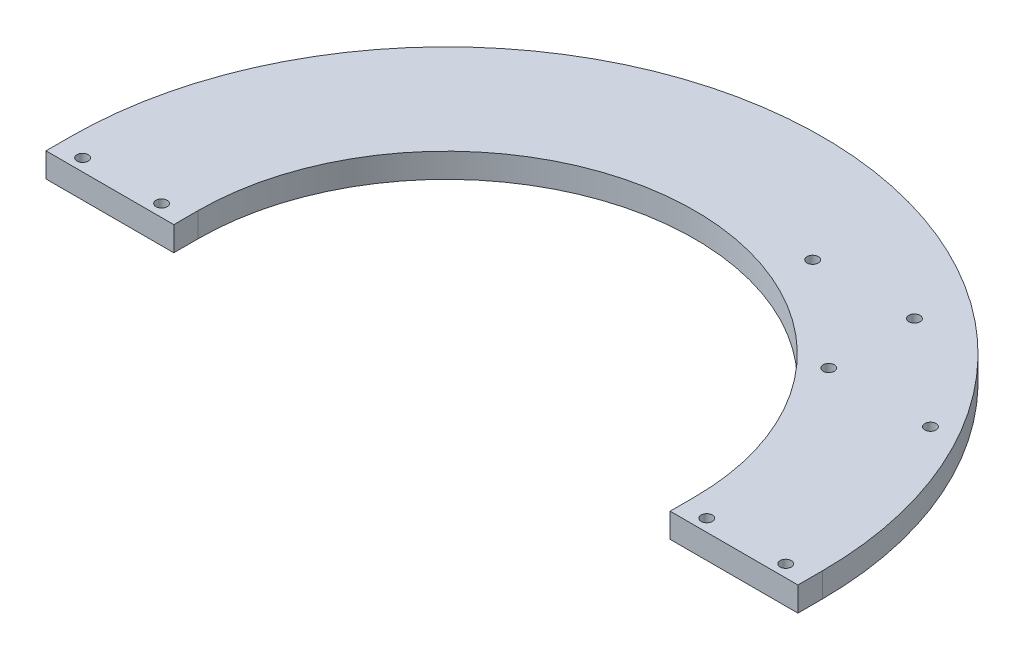
ISO-10303-21;
HEADER;
FILE_DESCRIPTION(('STEP AP214'),'2;1');
FILE_NAME('part.step','',(''),(''),'','','');
FILE_SCHEMA(('AUTOMOTIVE_DESIGN { 1 0 10303 214 1 1 1 1 }'));
ENDSEC;
DATA;
#1=APPLICATION_CONTEXT('core data for automotive mechanical design processes');
#2=APPLICATION_PROTOCOL_DEFINITION('international standard','automotive_design',2000,#1);
#3=PRODUCT_CONTEXT('',#1,'mechanical');
#4=PRODUCT('Part','Part','',(#3));
#5=PRODUCT_RELATED_PRODUCT_CATEGORY('part','',(#4));
#6=PRODUCT_DEFINITION_FORMATION('','',#4);
#7=PRODUCT_DEFINITION_CONTEXT('part definition',#1,'design');
#8=PRODUCT_DEFINITION('design','',#6,#7);
#9=PRODUCT_DEFINITION_SHAPE('','',#8);
#10=(LENGTH_UNIT() NAMED_UNIT(*) SI_UNIT(.MILLI.,.METRE.));
#11=(NAMED_UNIT(*) PLANE_ANGLE_UNIT() SI_UNIT($,.RADIAN.));
#12=(NAMED_UNIT(*) SI_UNIT($,.STERADIAN.) SOLID_ANGLE_UNIT());
#13=UNCERTAINTY_MEASURE_WITH_UNIT(LENGTH_MEASURE(1.E-05),#10,'distance_accuracy_value','');
#14=(GEOMETRIC_REPRESENTATION_CONTEXT(3) GLOBAL_UNCERTAINTY_ASSIGNED_CONTEXT((#13)) GLOBAL_UNIT_ASSIGNED_CONTEXT((#10,
#11,#12)) REPRESENTATION_CONTEXT('',''));
#15=CARTESIAN_POINT('',(0.,0.,0.));
#16=DIRECTION('',(0.,0.,1.));
#17=DIRECTION('',(1.,0.,0.));
#18=AXIS2_PLACEMENT_3D('',#15,#16,#17);
#19=CARTESIAN_POINT('',(-117.31625,7.62,7.62));
#20=DIRECTION('',(0.,0.,-1.));
#21=DIRECTION('',(-1.,0.,0.));
#22=AXIS2_PLACEMENT_3D('',#19,#20,#21);
#23=PLANE('',#22);
#24=DIRECTION('',(1.,0.,0.));
#25=VECTOR('',#24,1.);
#26=CARTESIAN_POINT('',(-117.31625,0.,7.62));
#27=LINE('',#26,#25);
#28=CARTESIAN_POINT('',(-117.31625,0.,7.62));
#29=VERTEX_POINT('',#28);
#30=CARTESIAN_POINT('',(-77.43825,0.,7.62));
#31=VERTEX_POINT('',#30);
#32=EDGE_CURVE('E140',#29,#31,#27,.T.);
#33=ORIENTED_EDGE('',*,*,#32,.T.);
#34=DIRECTION('',(0.,-1.,0.));
#35=VECTOR('',#34,1.);
#36=CARTESIAN_POINT('',(-77.43825,7.62,7.62));
#37=LINE('',#36,#35);
#38=CARTESIAN_POINT('',(-77.43825,7.62,7.62));
#39=VERTEX_POINT('',#38);
#40=EDGE_CURVE('E11',#39,#31,#37,.T.);
#41=ORIENTED_EDGE('',*,*,#40,.F.);
#42=DIRECTION('',(1.,0.,0.));
#43=VECTOR('',#42,1.);
#44=CARTESIAN_POINT('',(-117.31625,7.62,7.62));
#45=LINE('',#44,#43);
#46=CARTESIAN_POINT('',(-117.31625,7.62,7.62));
#47=VERTEX_POINT('',#46);
#48=EDGE_CURVE('E163',#47,#39,#45,.T.);
#49=ORIENTED_EDGE('',*,*,#48,.F.);
#50=DIRECTION('',(0.,-1.,0.));
#51=VECTOR('',#50,1.);
#52=CARTESIAN_POINT('',(-117.31625,7.62,7.62));
#53=LINE('',#52,#51);
#54=EDGE_CURVE('E136',#47,#29,#53,.T.);
#55=ORIENTED_EDGE('',*,*,#54,.T.);
#56=EDGE_LOOP('',(#33,#41,#49,#55));
#57=FACE_BOUND('',#56,.T.);
#58=ADVANCED_FACE('F39',(#57),#23,.F.);
#59=CARTESIAN_POINT('',(-77.43825,7.62,7.62));
#60=DIRECTION('',(-1.,0.,0.));
#61=DIRECTION('',(0.,0.,1.));
#62=AXIS2_PLACEMENT_3D('',#59,#60,#61);
#63=PLANE('',#62);
#64=DIRECTION('',(0.,0.,-1.));
#65=VECTOR('',#64,1.);
#66=CARTESIAN_POINT('',(-77.43825,0.,7.62));
#67=LINE('',#66,#65);
#68=CARTESIAN_POINT('',(-77.43825,0.,0.));
#69=VERTEX_POINT('',#68);
#70=EDGE_CURVE('E144',#31,#69,#67,.T.);
#71=ORIENTED_EDGE('',*,*,#70,.T.);
#72=DIRECTION('',(0.,-1.,0.));
#73=VECTOR('',#72,1.);
#74=CARTESIAN_POINT('',(-77.43825,7.62,0.));
#75=LINE('',#74,#73);
#76=CARTESIAN_POINT('',(-77.43825,7.62,0.));
#77=VERTEX_POINT('',#76);
#78=EDGE_CURVE('E48',#77,#69,#75,.T.);
#79=ORIENTED_EDGE('',*,*,#78,.F.);
#80=DIRECTION('',(0.,0.,-1.));
#81=VECTOR('',#80,1.);
#82=CARTESIAN_POINT('',(-77.43825,7.62,7.62));
#83=LINE('',#82,#81);
#84=EDGE_CURVE('E99',#39,#77,#83,.T.);
#85=ORIENTED_EDGE('',*,*,#84,.F.);
#86=ORIENTED_EDGE('',*,*,#40,.T.);
#87=EDGE_LOOP('',(#71,#79,#85,#86));
#88=FACE_BOUND('',#87,.T.);
#89=ADVANCED_FACE('F308',(#88),#63,.F.);
#90=CARTESIAN_POINT('',(0.,7.62,0.));
#91=DIRECTION('',(0.,-1.,0.));
#92=DIRECTION('',(0.,0.,-1.));
#93=AXIS2_PLACEMENT_3D('',#90,#91,#92);
#94=CYLINDRICAL_SURFACE('',#93,77.43825);
#95=CARTESIAN_POINT('',(0.,0.,0.));
#96=DIRECTION('',(0.,-1.,0.));
#97=DIRECTION('',(0.,0.,1.));
#98=AXIS2_PLACEMENT_3D('',#95,#96,#97);
#99=CIRCLE('',#98,77.43825);
#100=CARTESIAN_POINT('',(77.43825,0.,0.));
#101=VERTEX_POINT('',#100);
#102=EDGE_CURVE('E148',#69,#101,#99,.T.);
#103=ORIENTED_EDGE('',*,*,#102,.T.);
#104=DIRECTION('',(0.,-1.,0.));
#105=VECTOR('',#104,1.);
#106=CARTESIAN_POINT('',(77.43825,7.62,0.));
#107=LINE('',#106,#105);
#108=CARTESIAN_POINT('',(77.43825,7.62,0.));
#109=VERTEX_POINT('',#108);
#110=EDGE_CURVE('E174',#109,#101,#107,.T.);
#111=ORIENTED_EDGE('',*,*,#110,.F.);
#112=CARTESIAN_POINT('',(0.,7.62,0.));
#113=DIRECTION('',(0.,-1.,0.));
#114=DIRECTION('',(0.,0.,1.));
#115=AXIS2_PLACEMENT_3D('',#112,#113,#114);
#116=CIRCLE('',#115,77.43825);
#117=EDGE_CURVE('E184',#77,#109,#116,.T.);
#118=ORIENTED_EDGE('',*,*,#117,.F.);
#119=ORIENTED_EDGE('',*,*,#78,.T.);
#120=EDGE_LOOP('',(#103,#111,#118,#119));
#121=FACE_BOUND('',#120,.T.);
#122=ADVANCED_FACE('F182',(#121),#94,.F.);
#123=CARTESIAN_POINT('',(77.43825,7.62,0.));
#124=DIRECTION('',(1.,0.,0.));
#125=DIRECTION('',(0.,0.,-1.));
#126=AXIS2_PLACEMENT_3D('',#123,#124,#125);
#127=PLANE('',#126);
#128=DIRECTION('',(0.,0.,1.));
#129=VECTOR('',#128,1.);
#130=CARTESIAN_POINT('',(77.43825,0.,0.));
#131=LINE('',#130,#129);
#132=CARTESIAN_POINT('',(77.43825,0.,7.62));
#133=VERTEX_POINT('',#132);
#134=EDGE_CURVE('E151',#101,#133,#131,.T.);
#135=ORIENTED_EDGE('',*,*,#134,.T.);
#136=DIRECTION('',(0.,-1.,0.));
#137=VECTOR('',#136,1.);
#138=CARTESIAN_POINT('',(77.43825,7.62,7.62));
#139=LINE('',#138,#137);
#140=CARTESIAN_POINT('',(77.43825,7.62,7.62));
#141=VERTEX_POINT('',#140);
#142=EDGE_CURVE('E170',#141,#133,#139,.T.);
#143=ORIENTED_EDGE('',*,*,#142,.F.);
#144=DIRECTION('',(0.,0.,1.));
#145=VECTOR('',#144,1.);
#146=CARTESIAN_POINT('',(77.43825,7.62,0.));
#147=LINE('',#146,#145);
#148=EDGE_CURVE('E197',#109,#141,#147,.T.);
#149=ORIENTED_EDGE('',*,*,#148,.F.);
#150=ORIENTED_EDGE('',*,*,#110,.T.);
#151=EDGE_LOOP('',(#135,#143,#149,#150));
#152=FACE_BOUND('',#151,.T.);
#153=ADVANCED_FACE('F192',(#152),#127,.F.);
#154=CARTESIAN_POINT('',(77.43825,7.62,7.62));
#155=DIRECTION('',(0.,0.,-1.));
#156=DIRECTION('',(-1.,0.,0.));
#157=AXIS2_PLACEMENT_3D('',#154,#155,#156);
#158=PLANE('',#157);
#159=DIRECTION('',(1.,0.,0.));
#160=VECTOR('',#159,1.);
#161=CARTESIAN_POINT('',(77.43825,0.,7.62));
#162=LINE('',#161,#160);
#163=CARTESIAN_POINT('',(117.31625,0.,7.62));
#164=VERTEX_POINT('',#163);
#165=EDGE_CURVE('E154',#133,#164,#162,.T.);
#166=ORIENTED_EDGE('',*,*,#165,.T.);
#167=DIRECTION('',(0.,-1.,0.));
#168=VECTOR('',#167,1.);
#169=CARTESIAN_POINT('',(117.31625,7.62,7.62));
#170=LINE('',#169,#168);
#171=CARTESIAN_POINT('',(117.31625,7.62,7.62));
#172=VERTEX_POINT('',#171);
#173=EDGE_CURVE('E129',#172,#164,#170,.T.);
#174=ORIENTED_EDGE('',*,*,#173,.F.);
#175=DIRECTION('',(1.,0.,0.));
#176=VECTOR('',#175,1.);
#177=CARTESIAN_POINT('',(77.43825,7.62,7.62));
#178=LINE('',#177,#176);
#179=EDGE_CURVE('E118',#141,#172,#178,.T.);
#180=ORIENTED_EDGE('',*,*,#179,.F.);
#181=ORIENTED_EDGE('',*,*,#142,.T.);
#182=EDGE_LOOP('',(#166,#174,#180,#181));
#183=FACE_BOUND('',#182,.T.);
#184=ADVANCED_FACE('F195',(#183),#158,.F.);
#185=CARTESIAN_POINT('',(117.31625,7.62,7.62));
#186=DIRECTION('',(-1.,0.,0.));
#187=DIRECTION('',(0.,0.,1.));
#188=AXIS2_PLACEMENT_3D('',#185,#186,#187);
#189=PLANE('',#188);
#190=DIRECTION('',(0.,0.,-1.));
#191=VECTOR('',#190,1.);
#192=CARTESIAN_POINT('',(117.31625,0.,7.62));
#193=LINE('',#192,#191);
#194=CARTESIAN_POINT('',(117.31625,0.,0.));
#195=VERTEX_POINT('',#194);
#196=EDGE_CURVE('E127',#164,#195,#193,.T.);
#197=ORIENTED_EDGE('',*,*,#196,.T.);
#198=DIRECTION('',(0.,-1.,0.));
#199=VECTOR('',#198,1.);
#200=CARTESIAN_POINT('',(117.31625,7.62,0.));
#201=LINE('',#200,#199);
#202=CARTESIAN_POINT('',(117.31625,7.62,0.));
#203=VERTEX_POINT('',#202);
#204=EDGE_CURVE('E124',#203,#195,#201,.T.);
#205=ORIENTED_EDGE('',*,*,#204,.F.);
#206=DIRECTION('',(0.,0.,-1.));
#207=VECTOR('',#206,1.);
#208=CARTESIAN_POINT('',(117.31625,7.62,7.62));
#209=LINE('',#208,#207);
#210=EDGE_CURVE('E112',#172,#203,#209,.T.);
#211=ORIENTED_EDGE('',*,*,#210,.F.);
#212=ORIENTED_EDGE('',*,*,#173,.T.);
#213=EDGE_LOOP('',(#197,#205,#211,#212));
#214=FACE_BOUND('',#213,.T.);
#215=ADVANCED_FACE('F125',(#214),#189,.F.);
#216=CARTESIAN_POINT('',(0.,7.62,0.));
#217=DIRECTION('',(0.,-1.,0.));
#218=DIRECTION('',(0.,0.,-1.));
#219=AXIS2_PLACEMENT_3D('',#216,#217,#218);
#220=CYLINDRICAL_SURFACE('',#219,117.31625);
#221=CARTESIAN_POINT('',(0.,0.,0.));
#222=DIRECTION('',(0.,1.,0.));
#223=DIRECTION('',(0.,0.,1.));
#224=AXIS2_PLACEMENT_3D('',#221,#222,#223);
#225=CIRCLE('',#224,117.31625);
#226=CARTESIAN_POINT('',(-117.31625,0.,0.));
#227=VERTEX_POINT('',#226);
#228=EDGE_CURVE('E85',#195,#227,#225,.T.);
#229=ORIENTED_EDGE('',*,*,#228,.T.);
#230=DIRECTION('',(0.,-1.,0.));
#231=VECTOR('',#230,1.);
#232=CARTESIAN_POINT('',(-117.31625,7.62,0.));
#233=LINE('',#232,#231);
#234=CARTESIAN_POINT('',(-117.31625,7.62,0.));
#235=VERTEX_POINT('',#234);
#236=EDGE_CURVE('E130',#235,#227,#233,.T.);
#237=ORIENTED_EDGE('',*,*,#236,.F.);
#238=CARTESIAN_POINT('',(0.,7.62,0.));
#239=DIRECTION('',(0.,1.,0.));
#240=DIRECTION('',(0.,0.,1.));
#241=AXIS2_PLACEMENT_3D('',#238,#239,#240);
#242=CIRCLE('',#241,117.31625);
#243=EDGE_CURVE('E116',#203,#235,#242,.T.);
#244=ORIENTED_EDGE('',*,*,#243,.F.);
#245=ORIENTED_EDGE('',*,*,#204,.T.);
#246=EDGE_LOOP('',(#229,#237,#244,#245));
#247=FACE_BOUND('',#246,.T.);
#248=ADVANCED_FACE('F132',(#247),#220,.T.);
#249=CARTESIAN_POINT('',(-117.31625,7.62,0.));
#250=DIRECTION('',(1.,0.,0.));
#251=DIRECTION('',(0.,0.,-1.));
#252=AXIS2_PLACEMENT_3D('',#249,#250,#251);
#253=PLANE('',#252);
#254=DIRECTION('',(0.,0.,1.));
#255=VECTOR('',#254,1.);
#256=CARTESIAN_POINT('',(-117.31625,0.,0.));
#257=LINE('',#256,#255);
#258=EDGE_CURVE('E91',#227,#29,#257,.T.);
#259=ORIENTED_EDGE('',*,*,#258,.T.);
#260=ORIENTED_EDGE('',*,*,#54,.F.);
#261=DIRECTION('',(0.,0.,1.));
#262=VECTOR('',#261,1.);
#263=CARTESIAN_POINT('',(-117.31625,7.62,0.));
#264=LINE('',#263,#262);
#265=EDGE_CURVE('E56',#235,#47,#264,.T.);
#266=ORIENTED_EDGE('',*,*,#265,.F.);
#267=ORIENTED_EDGE('',*,*,#236,.T.);
#268=EDGE_LOOP('',(#259,#260,#266,#267));
#269=FACE_BOUND('',#268,.T.);
#270=ADVANCED_FACE('F276',(#269),#253,.F.);
#271=CARTESIAN_POINT('',(0.,7.62,0.));
#272=DIRECTION('',(0.,1.,0.));
#273=DIRECTION('',(0.,0.,1.));
#274=AXIS2_PLACEMENT_3D('',#271,#272,#273);
#275=PLANE('',#274);
#276=CARTESIAN_POINT('',(-109.69625,7.62,3.81));
#277=DIRECTION('',(0.,1.,0.));
#278=DIRECTION('',(0.,0.,1.));
#279=AXIS2_PLACEMENT_3D('',#276,#277,#278);
#280=CIRCLE('',#279,1.75259999999999);
#281=CARTESIAN_POINT('',(-109.69625,7.62,5.56259999999999));
#282=VERTEX_POINT('',#281);
#283=EDGE_CURVE('E221',#282,#282,#280,.T.);
#284=ORIENTED_EDGE('',*,*,#283,.F.);
#285=EDGE_LOOP('',(#284));
#286=FACE_BOUND('',#285,.T.);
#287=CARTESIAN_POINT('',(95.25,7.62,-55.8124282632022));
#288=DIRECTION('',(0.,1.,0.));
#289=DIRECTION('',(0.,0.,1.));
#290=AXIS2_PLACEMENT_3D('',#287,#288,#289);
#291=CIRCLE('',#290,1.75259999999999);
#292=CARTESIAN_POINT('',(95.25,7.62,-54.0598282632022));
#293=VERTEX_POINT('',#292);
#294=EDGE_CURVE('E245',#293,#293,#291,.T.);
#295=ORIENTED_EDGE('',*,*,#294,.F.);
#296=EDGE_LOOP('',(#295));
#297=FACE_BOUND('',#296,.T.);
#298=CARTESIAN_POINT('',(31.75,7.62,-82.55));
#299=DIRECTION('',(0.,1.,0.));
#300=DIRECTION('',(0.,0.,1.));
#301=AXIS2_PLACEMENT_3D('',#298,#299,#300);
#302=CIRCLE('',#301,1.75259999999999);
#303=CARTESIAN_POINT('',(31.75,7.62,-80.7974));
#304=VERTEX_POINT('',#303);
#305=EDGE_CURVE('E246',#304,#304,#302,.T.);
#306=ORIENTED_EDGE('',*,*,#305,.F.);
#307=EDGE_LOOP('',(#306));
#308=FACE_BOUND('',#307,.T.);
#309=CARTESIAN_POINT('',(63.5,7.62,-82.55));
#310=DIRECTION('',(0.,1.,0.));
#311=DIRECTION('',(0.,0.,1.));
#312=AXIS2_PLACEMENT_3D('',#309,#310,#311);
#313=CIRCLE('',#312,1.75259999999999);
#314=CARTESIAN_POINT('',(63.5,7.62,-80.7974));
#315=VERTEX_POINT('',#314);
#316=EDGE_CURVE('E260',#315,#315,#313,.T.);
#317=ORIENTED_EDGE('',*,*,#316,.F.);
#318=EDGE_LOOP('',(#317));
#319=FACE_BOUND('',#318,.T.);
#320=CARTESIAN_POINT('',(-85.05825,7.62,3.81));
#321=DIRECTION('',(0.,1.,0.));
#322=DIRECTION('',(0.,0.,1.));
#323=AXIS2_PLACEMENT_3D('',#320,#321,#322);
#324=CIRCLE('',#323,1.75259999999999);
#325=CARTESIAN_POINT('',(-85.05825,7.62,5.56259999999999));
#326=VERTEX_POINT('',#325);
#327=EDGE_CURVE('E211',#326,#326,#324,.T.);
#328=ORIENTED_EDGE('',*,*,#327,.F.);
#329=EDGE_LOOP('',(#328));
#330=FACE_BOUND('',#329,.T.);
#331=CARTESIAN_POINT('',(85.05825,7.62,3.81));
#332=DIRECTION('',(0.,1.,0.));
#333=DIRECTION('',(0.,0.,1.));
#334=AXIS2_PLACEMENT_3D('',#331,#332,#333);
#335=CIRCLE('',#334,1.75259999999999);
#336=CARTESIAN_POINT('',(85.05825,7.62,5.56259999999999));
#337=VERTEX_POINT('',#336);
#338=EDGE_CURVE('E212',#337,#337,#335,.T.);
#339=ORIENTED_EDGE('',*,*,#338,.F.);
#340=EDGE_LOOP('',(#339));
#341=FACE_BOUND('',#340,.T.);
#342=CARTESIAN_POINT('',(109.69625,7.62,3.81));
#343=DIRECTION('',(0.,1.,0.));
#344=DIRECTION('',(0.,0.,1.));
#345=AXIS2_PLACEMENT_3D('',#342,#343,#344);
#346=CIRCLE('',#345,1.75259999999999);
#347=CARTESIAN_POINT('',(109.69625,7.62,5.56259999999999));
#348=VERTEX_POINT('',#347);
#349=EDGE_CURVE('E229',#348,#348,#346,.T.);
#350=ORIENTED_EDGE('',*,*,#349,.F.);
#351=EDGE_LOOP('',(#350));
#352=FACE_BOUND('',#351,.T.);
#353=CARTESIAN_POINT('',(63.5,7.62,-55.8124282632022));
#354=DIRECTION('',(0.,1.,0.));
#355=DIRECTION('',(0.,0.,1.));
#356=AXIS2_PLACEMENT_3D('',#353,#354,#355);
#357=CIRCLE('',#356,1.7526);
#358=CARTESIAN_POINT('',(63.5,7.62,-54.0598282632022));
#359=VERTEX_POINT('',#358);
#360=EDGE_CURVE('E230',#359,#359,#357,.T.);
#361=ORIENTED_EDGE('',*,*,#360,.F.);
#362=EDGE_LOOP('',(#361));
#363=FACE_BOUND('',#362,.T.);
#364=ORIENTED_EDGE('',*,*,#48,.T.);
#365=ORIENTED_EDGE('',*,*,#84,.T.);
#366=ORIENTED_EDGE('',*,*,#117,.T.);
#367=ORIENTED_EDGE('',*,*,#148,.T.);
#368=ORIENTED_EDGE('',*,*,#179,.T.);
#369=ORIENTED_EDGE('',*,*,#210,.T.);
#370=ORIENTED_EDGE('',*,*,#243,.T.);
#371=ORIENTED_EDGE('',*,*,#265,.T.);
#372=EDGE_LOOP('',(#364,#365,#366,#367,#368,#369,#370,#371));
#373=FACE_BOUND('',#372,.T.);
#374=ADVANCED_FACE('F114',(#286,#297,#308,#319,#330,#341,#352,#363,#373),#275,.T.);
#375=CARTESIAN_POINT('',(0.,0.,0.));
#376=DIRECTION('',(0.,1.,0.));
#377=DIRECTION('',(0.,0.,1.));
#378=AXIS2_PLACEMENT_3D('',#375,#376,#377);
#379=PLANE('',#378);
#380=CARTESIAN_POINT('',(-109.69625,0.,3.81));
#381=DIRECTION('',(0.,1.,0.));
#382=DIRECTION('',(0.,0.,1.));
#383=AXIS2_PLACEMENT_3D('',#380,#381,#382);
#384=CIRCLE('',#383,1.75259999999999);
#385=CARTESIAN_POINT('',(-109.69625,0.,5.56259999999999));
#386=VERTEX_POINT('',#385);
#387=EDGE_CURVE('E145',#386,#386,#384,.F.);
#388=ORIENTED_EDGE('',*,*,#387,.F.);
#389=EDGE_LOOP('',(#388));
#390=FACE_BOUND('',#389,.T.);
#391=CARTESIAN_POINT('',(95.25,0.,-55.8124282632022));
#392=DIRECTION('',(0.,1.,0.));
#393=DIRECTION('',(0.,0.,1.));
#394=AXIS2_PLACEMENT_3D('',#391,#392,#393);
#395=CIRCLE('',#394,1.75259999999999);
#396=CARTESIAN_POINT('',(95.25,0.,-54.0598282632022));
#397=VERTEX_POINT('',#396);
#398=EDGE_CURVE('E234',#397,#397,#395,.F.);
#399=ORIENTED_EDGE('',*,*,#398,.F.);
#400=EDGE_LOOP('',(#399));
#401=FACE_BOUND('',#400,.T.);
#402=CARTESIAN_POINT('',(31.75,0.,-82.55));
#403=DIRECTION('',(0.,1.,0.));
#404=DIRECTION('',(0.,0.,1.));
#405=AXIS2_PLACEMENT_3D('',#402,#403,#404);
#406=CIRCLE('',#405,1.75259999999999);
#407=CARTESIAN_POINT('',(31.75,0.,-80.7974));
#408=VERTEX_POINT('',#407);
#409=EDGE_CURVE('E241',#408,#408,#406,.F.);
#410=ORIENTED_EDGE('',*,*,#409,.F.);
#411=EDGE_LOOP('',(#410));
#412=FACE_BOUND('',#411,.T.);
#413=CARTESIAN_POINT('',(63.5,0.,-82.55));
#414=DIRECTION('',(0.,1.,0.));
#415=DIRECTION('',(0.,0.,1.));
#416=AXIS2_PLACEMENT_3D('',#413,#414,#415);
#417=CIRCLE('',#416,1.75259999999999);
#418=CARTESIAN_POINT('',(63.5,0.,-80.7974));
#419=VERTEX_POINT('',#418);
#420=EDGE_CURVE('E250',#419,#419,#417,.F.);
#421=ORIENTED_EDGE('',*,*,#420,.F.);
#422=EDGE_LOOP('',(#421));
#423=FACE_BOUND('',#422,.T.);
#424=CARTESIAN_POINT('',(-85.05825,0.,3.81));
#425=DIRECTION('',(0.,1.,0.));
#426=DIRECTION('',(0.,0.,1.));
#427=AXIS2_PLACEMENT_3D('',#424,#425,#426);
#428=CIRCLE('',#427,1.75259999999999);
#429=CARTESIAN_POINT('',(-85.05825,0.,5.56259999999999));
#430=VERTEX_POINT('',#429);
#431=EDGE_CURVE('E217',#430,#430,#428,.F.);
#432=ORIENTED_EDGE('',*,*,#431,.F.);
#433=EDGE_LOOP('',(#432));
#434=FACE_BOUND('',#433,.T.);
#435=CARTESIAN_POINT('',(85.05825,0.,3.81));
#436=DIRECTION('',(0.,1.,0.));
#437=DIRECTION('',(0.,0.,1.));
#438=AXIS2_PLACEMENT_3D('',#435,#436,#437);
#439=CIRCLE('',#438,1.75259999999999);
#440=CARTESIAN_POINT('',(85.05825,0.,5.56259999999999));
#441=VERTEX_POINT('',#440);
#442=EDGE_CURVE('E207',#441,#441,#439,.F.);
#443=ORIENTED_EDGE('',*,*,#442,.F.);
#444=EDGE_LOOP('',(#443));
#445=FACE_BOUND('',#444,.T.);
#446=CARTESIAN_POINT('',(109.69625,0.,3.81));
#447=DIRECTION('',(0.,1.,0.));
#448=DIRECTION('',(0.,0.,1.));
#449=AXIS2_PLACEMENT_3D('',#446,#447,#448);
#450=CIRCLE('',#449,1.75259999999999);
#451=CARTESIAN_POINT('',(109.69625,0.,5.56259999999999));
#452=VERTEX_POINT('',#451);
#453=EDGE_CURVE('E216',#452,#452,#450,.F.);
#454=ORIENTED_EDGE('',*,*,#453,.F.);
#455=EDGE_LOOP('',(#454));
#456=FACE_BOUND('',#455,.T.);
#457=CARTESIAN_POINT('',(63.5,0.,-55.8124282632022));
#458=DIRECTION('',(0.,1.,0.));
#459=DIRECTION('',(0.,0.,1.));
#460=AXIS2_PLACEMENT_3D('',#457,#458,#459);
#461=CIRCLE('',#460,1.7526);
#462=CARTESIAN_POINT('',(63.5,0.,-54.0598282632022));
#463=VERTEX_POINT('',#462);
#464=EDGE_CURVE('E225',#463,#463,#461,.F.);
#465=ORIENTED_EDGE('',*,*,#464,.F.);
#466=EDGE_LOOP('',(#465));
#467=FACE_BOUND('',#466,.T.);
#468=ORIENTED_EDGE('',*,*,#32,.F.);
#469=ORIENTED_EDGE('',*,*,#258,.F.);
#470=ORIENTED_EDGE('',*,*,#228,.F.);
#471=ORIENTED_EDGE('',*,*,#196,.F.);
#472=ORIENTED_EDGE('',*,*,#165,.F.);
#473=ORIENTED_EDGE('',*,*,#134,.F.);
#474=ORIENTED_EDGE('',*,*,#102,.F.);
#475=ORIENTED_EDGE('',*,*,#70,.F.);
#476=EDGE_LOOP('',(#468,#469,#470,#471,#472,#473,#474,#475));
#477=FACE_BOUND('',#476,.T.);
#478=ADVANCED_FACE('F188',(#390,#401,#412,#423,#434,#445,#456,#467,#477),#379,.F.);
#479=CARTESIAN_POINT('',(63.5,-0.00100000000000013,-55.8124282632022));
#480=DIRECTION('',(0.,1.,0.));
#481=DIRECTION('',(0.,0.,1.));
#482=AXIS2_PLACEMENT_3D('',#479,#480,#481);
#483=CYLINDRICAL_SURFACE('',#482,1.7526);
#484=ORIENTED_EDGE('',*,*,#360,.T.);
#485=EDGE_LOOP('',(#484));
#486=FACE_BOUND('',#485,.T.);
#487=ORIENTED_EDGE('',*,*,#464,.T.);
#488=EDGE_LOOP('',(#487));
#489=FACE_BOUND('',#488,.T.);
#490=ADVANCED_FACE('F292',(#486,#489),#483,.F.);
#491=CARTESIAN_POINT('',(109.69625,-0.00100000000000013,3.81));
#492=DIRECTION('',(0.,1.,0.));
#493=DIRECTION('',(0.,0.,1.));
#494=AXIS2_PLACEMENT_3D('',#491,#492,#493);
#495=CYLINDRICAL_SURFACE('',#494,1.75259999999999);
#496=ORIENTED_EDGE('',*,*,#349,.T.);
#497=EDGE_LOOP('',(#496));
#498=FACE_BOUND('',#497,.T.);
#499=ORIENTED_EDGE('',*,*,#453,.T.);
#500=EDGE_LOOP('',(#499));
#501=FACE_BOUND('',#500,.T.);
#502=ADVANCED_FACE('F295',(#498,#501),#495,.F.);
#503=CARTESIAN_POINT('',(85.05825,-0.00100000000000013,3.81));
#504=DIRECTION('',(0.,1.,0.));
#505=DIRECTION('',(0.,0.,1.));
#506=AXIS2_PLACEMENT_3D('',#503,#504,#505);
#507=CYLINDRICAL_SURFACE('',#506,1.75259999999999);
#508=ORIENTED_EDGE('',*,*,#338,.T.);
#509=EDGE_LOOP('',(#508));
#510=FACE_BOUND('',#509,.T.);
#511=ORIENTED_EDGE('',*,*,#442,.T.);
#512=EDGE_LOOP('',(#511));
#513=FACE_BOUND('',#512,.T.);
#514=ADVANCED_FACE('F377',(#510,#513),#507,.F.);
#515=CARTESIAN_POINT('',(-85.05825,-0.00100000000000013,3.81));
#516=DIRECTION('',(0.,1.,0.));
#517=DIRECTION('',(0.,0.,1.));
#518=AXIS2_PLACEMENT_3D('',#515,#516,#517);
#519=CYLINDRICAL_SURFACE('',#518,1.75259999999999);
#520=ORIENTED_EDGE('',*,*,#327,.T.);
#521=EDGE_LOOP('',(#520));
#522=FACE_BOUND('',#521,.T.);
#523=ORIENTED_EDGE('',*,*,#431,.T.);
#524=EDGE_LOOP('',(#523));
#525=FACE_BOUND('',#524,.T.);
#526=ADVANCED_FACE('F387',(#522,#525),#519,.F.);
#527=CARTESIAN_POINT('',(63.5,-0.00100000000000013,-82.55));
#528=DIRECTION('',(0.,1.,0.));
#529=DIRECTION('',(0.,0.,1.));
#530=AXIS2_PLACEMENT_3D('',#527,#528,#529);
#531=CYLINDRICAL_SURFACE('',#530,1.75259999999999);
#532=ORIENTED_EDGE('',*,*,#316,.T.);
#533=EDGE_LOOP('',(#532));
#534=FACE_BOUND('',#533,.T.);
#535=ORIENTED_EDGE('',*,*,#420,.T.);
#536=EDGE_LOOP('',(#535));
#537=FACE_BOUND('',#536,.T.);
#538=ADVANCED_FACE('F397',(#534,#537),#531,.F.);
#539=CARTESIAN_POINT('',(31.75,-0.00100000000000013,-82.55));
#540=DIRECTION('',(0.,1.,0.));
#541=DIRECTION('',(0.,0.,1.));
#542=AXIS2_PLACEMENT_3D('',#539,#540,#541);
#543=CYLINDRICAL_SURFACE('',#542,1.75259999999999);
#544=ORIENTED_EDGE('',*,*,#305,.T.);
#545=EDGE_LOOP('',(#544));
#546=FACE_BOUND('',#545,.T.);
#547=ORIENTED_EDGE('',*,*,#409,.T.);
#548=EDGE_LOOP('',(#547));
#549=FACE_BOUND('',#548,.T.);
#550=ADVANCED_FACE('F407',(#546,#549),#543,.F.);
#551=CARTESIAN_POINT('',(95.25,-0.00100000000000013,-55.8124282632022));
#552=DIRECTION('',(0.,1.,0.));
#553=DIRECTION('',(0.,0.,1.));
#554=AXIS2_PLACEMENT_3D('',#551,#552,#553);
#555=CYLINDRICAL_SURFACE('',#554,1.75259999999999);
#556=ORIENTED_EDGE('',*,*,#294,.T.);
#557=EDGE_LOOP('',(#556));
#558=FACE_BOUND('',#557,.T.);
#559=ORIENTED_EDGE('',*,*,#398,.T.);
#560=EDGE_LOOP('',(#559));
#561=FACE_BOUND('',#560,.T.);
#562=ADVANCED_FACE('F417',(#558,#561),#555,.F.);
#563=CARTESIAN_POINT('',(-109.69625,-0.00100000000000013,3.81));
#564=DIRECTION('',(0.,1.,0.));
#565=DIRECTION('',(0.,0.,1.));
#566=AXIS2_PLACEMENT_3D('',#563,#564,#565);
#567=CYLINDRICAL_SURFACE('',#566,1.75259999999999);
#568=ORIENTED_EDGE('',*,*,#283,.T.);
#569=EDGE_LOOP('',(#568));
#570=FACE_BOUND('',#569,.T.);
#571=ORIENTED_EDGE('',*,*,#387,.T.);
#572=EDGE_LOOP('',(#571));
#573=FACE_BOUND('',#572,.T.);
#574=ADVANCED_FACE('F271',(#570,#573),#567,.F.);
#575=CLOSED_SHELL('',(#58,#89,#122,#153,#184,#215,#248,#270,#374,#478,#490,#502,#514,#526,#538,
#550,#562,#574));
#576=MANIFOLD_SOLID_BREP('B2',#575);
#577=ADVANCED_BREP_SHAPE_REPRESENTATION('',(#18,#576),#14);
#578=SHAPE_DEFINITION_REPRESENTATION(#9,#577);
ENDSEC;
END-ISO-10303-21;
